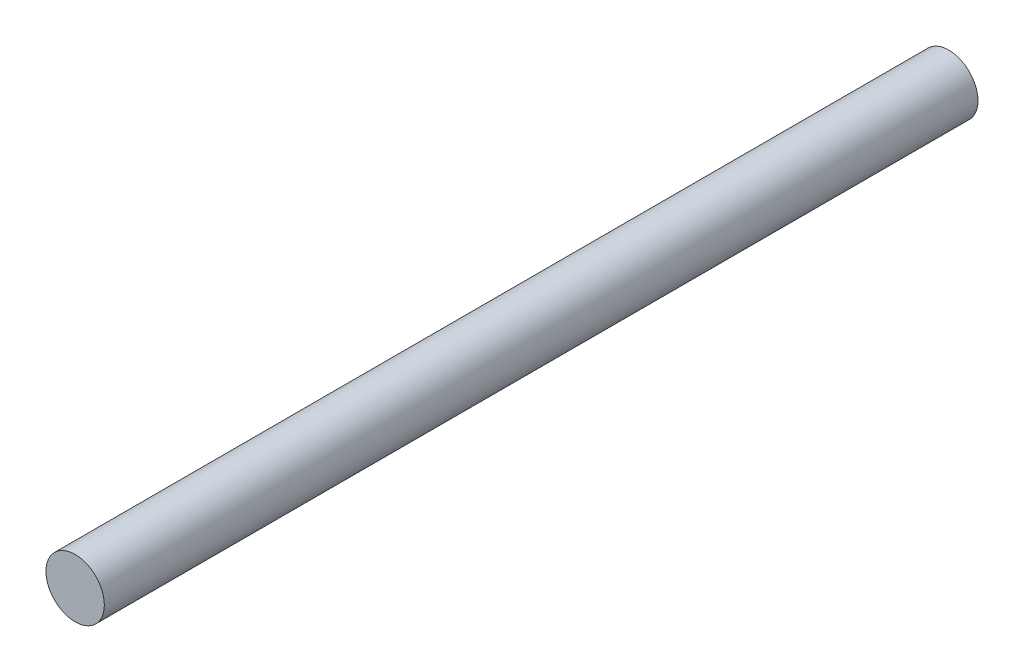
ISO-10303-21;
HEADER;
FILE_DESCRIPTION(('STEP AP214'),'2;1');
FILE_NAME('part.step','',(''),(''),'','','');
FILE_SCHEMA(('AUTOMOTIVE_DESIGN { 1 0 10303 214 1 1 1 1 }'));
ENDSEC;
DATA;
#1=APPLICATION_CONTEXT('core data for automotive mechanical design processes');
#2=APPLICATION_PROTOCOL_DEFINITION('international standard','automotive_design',2000,#1);
#3=PRODUCT_CONTEXT('',#1,'mechanical');
#4=PRODUCT('Part','Part','',(#3));
#5=PRODUCT_RELATED_PRODUCT_CATEGORY('part','',(#4));
#6=PRODUCT_DEFINITION_FORMATION('','',#4);
#7=PRODUCT_DEFINITION_CONTEXT('part definition',#1,'design');
#8=PRODUCT_DEFINITION('design','',#6,#7);
#9=PRODUCT_DEFINITION_SHAPE('','',#8);
#10=(LENGTH_UNIT() NAMED_UNIT(*) SI_UNIT(.MILLI.,.METRE.));
#11=(NAMED_UNIT(*) PLANE_ANGLE_UNIT() SI_UNIT($,.RADIAN.));
#12=(NAMED_UNIT(*) SI_UNIT($,.STERADIAN.) SOLID_ANGLE_UNIT());
#13=UNCERTAINTY_MEASURE_WITH_UNIT(LENGTH_MEASURE(1.E-05),#10,'distance_accuracy_value','');
#14=(GEOMETRIC_REPRESENTATION_CONTEXT(3) GLOBAL_UNCERTAINTY_ASSIGNED_CONTEXT((#13)) GLOBAL_UNIT_ASSIGNED_CONTEXT((#10,
#11,#12)) REPRESENTATION_CONTEXT('',''));
#15=CARTESIAN_POINT('',(0.,0.,0.));
#16=DIRECTION('',(0.,0.,1.));
#17=DIRECTION('',(1.,0.,0.));
#18=AXIS2_PLACEMENT_3D('',#15,#16,#17);
#19=CARTESIAN_POINT('',(0.,0.,47.5));
#20=DIRECTION('',(0.,0.,-1.));
#21=DIRECTION('',(-1.,0.,0.));
#22=AXIS2_PLACEMENT_3D('',#19,#20,#21);
#23=CYLINDRICAL_SURFACE('',#22,3.175);
#24=CARTESIAN_POINT('',(0.,0.,47.5));
#25=DIRECTION('',(0.,0.,1.));
#26=DIRECTION('',(1.,0.,0.));
#27=AXIS2_PLACEMENT_3D('',#24,#25,#26);
#28=CIRCLE('',#27,3.175);
#29=CARTESIAN_POINT('',(3.175,0.,47.5));
#30=VERTEX_POINT('',#29);
#31=EDGE_CURVE('E10',#30,#30,#28,.T.);
#32=ORIENTED_EDGE('',*,*,#31,.F.);
#33=EDGE_LOOP('',(#32));
#34=FACE_BOUND('',#33,.T.);
#35=CARTESIAN_POINT('',(0.,0.,-47.5));
#36=DIRECTION('',(0.,0.,1.));
#37=DIRECTION('',(1.,0.,0.));
#38=AXIS2_PLACEMENT_3D('',#35,#36,#37);
#39=CIRCLE('',#38,3.175);
#40=CARTESIAN_POINT('',(3.175,0.,-47.5));
#41=VERTEX_POINT('',#40);
#42=EDGE_CURVE('E34',#41,#41,#39,.T.);
#43=ORIENTED_EDGE('',*,*,#42,.T.);
#44=EDGE_LOOP('',(#43));
#45=FACE_BOUND('',#44,.T.);
#46=ADVANCED_FACE('F31',(#34,#45),#23,.T.);
#47=CARTESIAN_POINT('',(0.,0.,47.5));
#48=DIRECTION('',(0.,0.,1.));
#49=DIRECTION('',(1.,0.,0.));
#50=AXIS2_PLACEMENT_3D('',#47,#48,#49);
#51=PLANE('',#50);
#52=ORIENTED_EDGE('',*,*,#31,.T.);
#53=EDGE_LOOP('',(#52));
#54=FACE_BOUND('',#53,.T.);
#55=ADVANCED_FACE('F46',(#54),#51,.T.);
#56=CARTESIAN_POINT('',(0.,0.,-47.5));
#57=DIRECTION('',(0.,0.,1.));
#58=DIRECTION('',(1.,0.,0.));
#59=AXIS2_PLACEMENT_3D('',#56,#57,#58);
#60=PLANE('',#59);
#61=ORIENTED_EDGE('',*,*,#42,.F.);
#62=EDGE_LOOP('',(#61));
#63=FACE_BOUND('',#62,.T.);
#64=ADVANCED_FACE('F44',(#63),#60,.F.);
#65=CLOSED_SHELL('',(#46,#55,#64));
#66=MANIFOLD_SOLID_BREP('B2',#65);
#67=ADVANCED_BREP_SHAPE_REPRESENTATION('',(#18,#66),#14);
#68=SHAPE_DEFINITION_REPRESENTATION(#9,#67);
ENDSEC;
END-ISO-10303-21;
